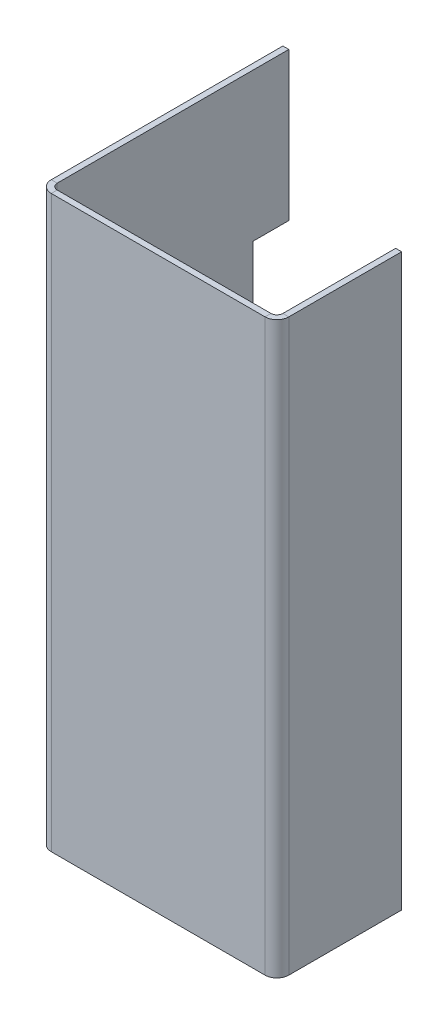
ISO-10303-21;
HEADER;
FILE_DESCRIPTION(('STEP AP214'),'2;1');
FILE_NAME('part.step','',(''),(''),'','','');
FILE_SCHEMA(('AUTOMOTIVE_DESIGN { 1 0 10303 214 1 1 1 1 }'));
ENDSEC;
DATA;
#1=APPLICATION_CONTEXT('core data for automotive mechanical design processes');
#2=APPLICATION_PROTOCOL_DEFINITION('international standard','automotive_design',2000,#1);
#3=PRODUCT_CONTEXT('',#1,'mechanical');
#4=PRODUCT('Part','Part','',(#3));
#5=PRODUCT_RELATED_PRODUCT_CATEGORY('part','',(#4));
#6=PRODUCT_DEFINITION_FORMATION('','',#4);
#7=PRODUCT_DEFINITION_CONTEXT('part definition',#1,'design');
#8=PRODUCT_DEFINITION('design','',#6,#7);
#9=PRODUCT_DEFINITION_SHAPE('','',#8);
#10=(LENGTH_UNIT() NAMED_UNIT(*) SI_UNIT(.MILLI.,.METRE.));
#11=(NAMED_UNIT(*) PLANE_ANGLE_UNIT() SI_UNIT($,.RADIAN.));
#12=(NAMED_UNIT(*) SI_UNIT($,.STERADIAN.) SOLID_ANGLE_UNIT());
#13=UNCERTAINTY_MEASURE_WITH_UNIT(LENGTH_MEASURE(1.E-05),#10,'distance_accuracy_value','');
#14=(GEOMETRIC_REPRESENTATION_CONTEXT(3) GLOBAL_UNCERTAINTY_ASSIGNED_CONTEXT((#13)) GLOBAL_UNIT_ASSIGNED_CONTEXT((#10,
#11,#12)) REPRESENTATION_CONTEXT('',''));
#15=CARTESIAN_POINT('',(0.,0.,0.));
#16=DIRECTION('',(0.,0.,1.));
#17=DIRECTION('',(1.,0.,0.));
#18=AXIS2_PLACEMENT_3D('',#15,#16,#17);
#19=CARTESIAN_POINT('',(-31.7500000000002,76.1999999999999,-65.0875));
#20=DIRECTION('',(0.,0.,-1.));
#21=DIRECTION('',(-1.,0.,0.));
#22=AXIS2_PLACEMENT_3D('',#19,#20,#21);
#23=PLANE('',#22);
#24=DIRECTION('',(1.,0.,0.));
#25=VECTOR('',#24,1.);
#26=CARTESIAN_POINT('',(-31.7500000000004,-45.974,-65.0875));
#27=LINE('',#26,#25);
#28=CARTESIAN_POINT('',(-31.7500000000004,-45.974,-65.0875));
#29=VERTEX_POINT('',#28);
#30=CARTESIAN_POINT('',(-30.1625000000002,-45.974,-65.0875));
#31=VERTEX_POINT('',#30);
#32=EDGE_CURVE('E236',#29,#31,#27,.T.);
#33=ORIENTED_EDGE('',*,*,#32,.T.);
#34=DIRECTION('',(0.,-1.,0.));
#35=VECTOR('',#34,1.);
#36=CARTESIAN_POINT('',(-30.1625000000002,0.,-65.0875));
#37=LINE('',#36,#35);
#38=CARTESIAN_POINT('',(-30.1625000000002,-76.2,-65.0875));
#39=VERTEX_POINT('',#38);
#40=EDGE_CURVE('E278',#39,#31,#37,.F.);
#41=ORIENTED_EDGE('',*,*,#40,.F.);
#42=DIRECTION('',(1.,0.,0.));
#43=VECTOR('',#42,1.);
#44=CARTESIAN_POINT('',(-31.7500000000002,-76.2,-65.0875));
#45=LINE('',#44,#43);
#46=CARTESIAN_POINT('',(-31.7500000000002,-76.2,-65.0875));
#47=VERTEX_POINT('',#46);
#48=EDGE_CURVE('E264',#47,#39,#45,.T.);
#49=ORIENTED_EDGE('',*,*,#48,.F.);
#50=DIRECTION('',(0.,1.,0.));
#51=VECTOR('',#50,1.);
#52=CARTESIAN_POINT('',(-31.7500000000002,76.1999999999999,-65.0875));
#53=LINE('',#52,#51);
#54=EDGE_CURVE('E270',#47,#29,#53,.T.);
#55=ORIENTED_EDGE('',*,*,#54,.T.);
#56=EDGE_LOOP('',(#33,#41,#49,#55));
#57=FACE_BOUND('',#56,.T.);
#58=ADVANCED_FACE('F90',(#57),#23,.T.);
#59=CARTESIAN_POINT('',(-30.1625,0.,1.11022302462516E-13));
#60=DIRECTION('',(-1.,0.,0.));
#61=DIRECTION('',(0.,0.,1.));
#62=AXIS2_PLACEMENT_3D('',#59,#60,#61);
#63=PLANE('',#62);
#64=CARTESIAN_POINT('',(-30.1625,0.,-9.52500000000001));
#65=DIRECTION('',(-1.,0.,0.));
#66=DIRECTION('',(0.,0.,1.));
#67=AXIS2_PLACEMENT_3D('',#64,#65,#66);
#68=CIRCLE('',#67,1.63194999999999);
#69=CARTESIAN_POINT('',(-30.1625,0.,-7.89305000000001));
#70=VERTEX_POINT('',#69);
#71=EDGE_CURVE('E248',#70,#70,#68,.F.);
#72=ORIENTED_EDGE('',*,*,#71,.F.);
#73=EDGE_LOOP('',(#72));
#74=FACE_BOUND('',#73,.T.);
#75=CARTESIAN_POINT('',(-30.1625,50.8,-9.52500000000001));
#76=DIRECTION('',(-1.,0.,0.));
#77=DIRECTION('',(0.,0.,1.));
#78=AXIS2_PLACEMENT_3D('',#75,#76,#77);
#79=CIRCLE('',#78,1.63194999999999);
#80=CARTESIAN_POINT('',(-30.1625,50.8,-7.89305000000002));
#81=VERTEX_POINT('',#80);
#82=EDGE_CURVE('E254',#81,#81,#79,.F.);
#83=ORIENTED_EDGE('',*,*,#82,.F.);
#84=EDGE_LOOP('',(#83));
#85=FACE_BOUND('',#84,.T.);
#86=ORIENTED_EDGE('',*,*,#40,.T.);
#87=DIRECTION('',(0.,0.,-1.));
#88=VECTOR('',#87,1.);
#89=CARTESIAN_POINT('',(-30.1625000000002,-45.974,-65.0875));
#90=LINE('',#89,#88);
#91=CARTESIAN_POINT('',(-30.1625000000002,-45.974,-55.5625));
#92=VERTEX_POINT('',#91);
#93=EDGE_CURVE('E228',#92,#31,#90,.T.);
#94=ORIENTED_EDGE('',*,*,#93,.F.);
#95=DIRECTION('',(0.,-1.,0.));
#96=VECTOR('',#95,1.);
#97=CARTESIAN_POINT('',(-30.1625000000002,36.576,-55.5625));
#98=LINE('',#97,#96);
#99=CARTESIAN_POINT('',(-30.1625000000002,36.576,-55.5625));
#100=VERTEX_POINT('',#99);
#101=EDGE_CURVE('E230',#100,#92,#98,.T.);
#102=ORIENTED_EDGE('',*,*,#101,.F.);
#103=DIRECTION('',(0.,0.,1.));
#104=VECTOR('',#103,1.);
#105=CARTESIAN_POINT('',(-30.1625000000002,36.576,-65.0875));
#106=LINE('',#105,#104);
#107=CARTESIAN_POINT('',(-30.1625000000002,36.576,-65.0875));
#108=VERTEX_POINT('',#107);
#109=EDGE_CURVE('E208',#108,#100,#106,.T.);
#110=ORIENTED_EDGE('',*,*,#109,.F.);
#111=CARTESIAN_POINT('',(-30.1625000000002,76.1999999999999,-65.0875));
#112=VERTEX_POINT('',#111);
#113=EDGE_CURVE('E281',#108,#112,#37,.F.);
#114=ORIENTED_EDGE('',*,*,#113,.T.);
#115=DIRECTION('',(0.,0.,-1.));
#116=VECTOR('',#115,1.);
#117=CARTESIAN_POINT('',(-30.1625,76.2,0.));
#118=LINE('',#117,#116);
#119=CARTESIAN_POINT('',(-30.1625,76.2,-3.17500000000001));
#120=VERTEX_POINT('',#119);
#121=EDGE_CURVE('E275',#112,#120,#118,.F.);
#122=ORIENTED_EDGE('',*,*,#121,.T.);
#123=DIRECTION('',(0.,-1.,0.));
#124=VECTOR('',#123,1.);
#125=CARTESIAN_POINT('',(-30.1625,-76.2,-3.17499999999999));
#126=LINE('',#125,#124);
#127=CARTESIAN_POINT('',(-30.1625,-76.2,-3.17499999999999));
#128=VERTEX_POINT('',#127);
#129=EDGE_CURVE('E290',#128,#120,#126,.F.);
#130=ORIENTED_EDGE('',*,*,#129,.F.);
#131=DIRECTION('',(0.,0.,1.));
#132=VECTOR('',#131,1.);
#133=CARTESIAN_POINT('',(-30.1625,-76.2,1.27675647831893E-13));
#134=LINE('',#133,#132);
#135=EDGE_CURVE('E282',#128,#39,#134,.F.);
#136=ORIENTED_EDGE('',*,*,#135,.T.);
#137=EDGE_LOOP('',(#86,#94,#102,#110,#114,#122,#130,#136));
#138=FACE_BOUND('',#137,.T.);
#139=CARTESIAN_POINT('',(-30.1625,-50.8,-9.52500000000001));
#140=DIRECTION('',(-1.,0.,0.));
#141=DIRECTION('',(0.,0.,1.));
#142=AXIS2_PLACEMENT_3D('',#139,#140,#141);
#143=CIRCLE('',#142,1.63194999999999);
#144=CARTESIAN_POINT('',(-30.1625,-50.8,-7.89305000000002));
#145=VERTEX_POINT('',#144);
#146=EDGE_CURVE('E242',#145,#145,#143,.F.);
#147=ORIENTED_EDGE('',*,*,#146,.F.);
#148=EDGE_LOOP('',(#147));
#149=FACE_BOUND('',#148,.T.);
#150=ADVANCED_FACE('F421',(#74,#85,#138,#149),#63,.F.);
#151=CARTESIAN_POINT('',(0.,0.,-1.5875));
#152=DIRECTION('',(0.,0.,-1.));
#153=DIRECTION('',(-1.,0.,0.));
#154=AXIS2_PLACEMENT_3D('',#151,#152,#153);
#155=PLANE('',#154);
#156=DIRECTION('',(1.,0.,0.));
#157=VECTOR('',#156,1.);
#158=CARTESIAN_POINT('',(-31.75,-76.2,-1.5875));
#159=LINE('',#158,#157);
#160=CARTESIAN_POINT('',(-28.575,-76.2,-1.58749999999999));
#161=VERTEX_POINT('',#160);
#162=CARTESIAN_POINT('',(28.575,-76.2,-1.5875));
#163=VERTEX_POINT('',#162);
#164=EDGE_CURVE('E15',#161,#163,#159,.T.);
#165=ORIENTED_EDGE('',*,*,#164,.F.);
#166=DIRECTION('',(0.,1.,0.));
#167=VECTOR('',#166,1.);
#168=CARTESIAN_POINT('',(-28.575,76.2,-1.58750000000001));
#169=LINE('',#168,#167);
#170=CARTESIAN_POINT('',(-28.575,76.2,-1.58750000000001));
#171=VERTEX_POINT('',#170);
#172=EDGE_CURVE('E306',#171,#161,#169,.F.);
#173=ORIENTED_EDGE('',*,*,#172,.F.);
#174=DIRECTION('',(-1.,0.,0.));
#175=VECTOR('',#174,1.);
#176=CARTESIAN_POINT('',(-31.75,76.2,-1.5875));
#177=LINE('',#176,#175);
#178=CARTESIAN_POINT('',(28.575,76.2,-1.5875));
#179=VERTEX_POINT('',#178);
#180=EDGE_CURVE('E99',#179,#171,#177,.T.);
#181=ORIENTED_EDGE('',*,*,#180,.F.);
#182=DIRECTION('',(0.,-1.,0.));
#183=VECTOR('',#182,1.);
#184=CARTESIAN_POINT('',(28.575,-76.2,-1.58750000000001));
#185=LINE('',#184,#183);
#186=EDGE_CURVE('E361',#163,#179,#185,.F.);
#187=ORIENTED_EDGE('',*,*,#186,.F.);
#188=EDGE_LOOP('',(#165,#173,#181,#187));
#189=FACE_BOUND('',#188,.T.);
#190=ADVANCED_FACE('F428',(#189),#155,.T.);
#191=CARTESIAN_POINT('',(0.,0.,0.));
#192=DIRECTION('',(0.,0.,-1.));
#193=DIRECTION('',(-1.,0.,0.));
#194=AXIS2_PLACEMENT_3D('',#191,#192,#193);
#195=PLANE('',#194);
#196=DIRECTION('',(0.,1.,0.));
#197=VECTOR('',#196,1.);
#198=CARTESIAN_POINT('',(-28.575,76.2,0.));
#199=LINE('',#198,#197);
#200=CARTESIAN_POINT('',(-28.575,76.2,0.));
#201=VERTEX_POINT('',#200);
#202=CARTESIAN_POINT('',(-28.575,-76.2,0.));
#203=VERTEX_POINT('',#202);
#204=EDGE_CURVE('E294',#201,#203,#199,.F.);
#205=ORIENTED_EDGE('',*,*,#204,.T.);
#206=DIRECTION('',(1.,0.,0.));
#207=VECTOR('',#206,1.);
#208=CARTESIAN_POINT('',(-31.75,-76.2,0.));
#209=LINE('',#208,#207);
#210=CARTESIAN_POINT('',(28.575,-76.2,0.));
#211=VERTEX_POINT('',#210);
#212=EDGE_CURVE('E94',#203,#211,#209,.T.);
#213=ORIENTED_EDGE('',*,*,#212,.T.);
#214=DIRECTION('',(0.,-1.,0.));
#215=VECTOR('',#214,1.);
#216=CARTESIAN_POINT('',(28.575,-76.2,0.));
#217=LINE('',#216,#215);
#218=CARTESIAN_POINT('',(28.575,76.2,0.));
#219=VERTEX_POINT('',#218);
#220=EDGE_CURVE('E349',#211,#219,#217,.F.);
#221=ORIENTED_EDGE('',*,*,#220,.T.);
#222=DIRECTION('',(-1.,0.,0.));
#223=VECTOR('',#222,1.);
#224=CARTESIAN_POINT('',(-31.75,76.2,0.));
#225=LINE('',#224,#223);
#226=EDGE_CURVE('E367',#219,#201,#225,.T.);
#227=ORIENTED_EDGE('',*,*,#226,.T.);
#228=EDGE_LOOP('',(#205,#213,#221,#227));
#229=FACE_BOUND('',#228,.T.);
#230=ADVANCED_FACE('F372',(#229),#195,.F.);
#231=CARTESIAN_POINT('',(-31.75,76.2,-1.5875));
#232=DIRECTION('',(0.,1.,0.));
#233=DIRECTION('',(0.,0.,1.));
#234=AXIS2_PLACEMENT_3D('',#231,#232,#233);
#235=PLANE('',#234);
#236=ORIENTED_EDGE('',*,*,#180,.T.);
#237=DIRECTION('',(0.,0.,1.));
#238=VECTOR('',#237,1.);
#239=CARTESIAN_POINT('',(-28.575,76.2,-1.58750000000001));
#240=LINE('',#239,#238);
#241=EDGE_CURVE('E300',#171,#201,#240,.T.);
#242=ORIENTED_EDGE('',*,*,#241,.T.);
#243=ORIENTED_EDGE('',*,*,#226,.F.);
#244=DIRECTION('',(0.,0.,1.));
#245=VECTOR('',#244,1.);
#246=CARTESIAN_POINT('',(28.575,76.2,-1.58749999999999));
#247=LINE('',#246,#245);
#248=EDGE_CURVE('E115',#179,#219,#247,.T.);
#249=ORIENTED_EDGE('',*,*,#248,.F.);
#250=EDGE_LOOP('',(#236,#242,#243,#249));
#251=FACE_BOUND('',#250,.T.);
#252=ADVANCED_FACE('F92',(#251),#235,.T.);
#253=CARTESIAN_POINT('',(-31.75,-76.2,-1.5875));
#254=DIRECTION('',(0.,-1.,0.));
#255=DIRECTION('',(0.,0.,-1.));
#256=AXIS2_PLACEMENT_3D('',#253,#254,#255);
#257=PLANE('',#256);
#258=DIRECTION('',(0.,0.,1.));
#259=VECTOR('',#258,1.);
#260=CARTESIAN_POINT('',(-28.575,-76.2,-1.58749999999999));
#261=LINE('',#260,#259);
#262=EDGE_CURVE('E311',#161,#203,#261,.T.);
#263=ORIENTED_EDGE('',*,*,#262,.F.);
#264=ORIENTED_EDGE('',*,*,#164,.T.);
#265=DIRECTION('',(0.,0.,1.));
#266=VECTOR('',#265,1.);
#267=CARTESIAN_POINT('',(28.575,-76.2,-1.58750000000001));
#268=LINE('',#267,#266);
#269=EDGE_CURVE('E355',#163,#211,#268,.T.);
#270=ORIENTED_EDGE('',*,*,#269,.T.);
#271=ORIENTED_EDGE('',*,*,#212,.F.);
#272=EDGE_LOOP('',(#263,#264,#270,#271));
#273=FACE_BOUND('',#272,.T.);
#274=ADVANCED_FACE('F377',(#273),#257,.T.);
#275=CARTESIAN_POINT('',(28.575,76.2,-3.17499999999999));
#276=DIRECTION('',(0.,1.,0.));
#277=DIRECTION('',(0.,0.,1.));
#278=AXIS2_PLACEMENT_3D('',#275,#276,#277);
#279=PLANE('',#278);
#280=DIRECTION('',(1.,0.,0.));
#281=VECTOR('',#280,1.);
#282=CARTESIAN_POINT('',(31.75,76.2,-3.17499999999999));
#283=LINE('',#282,#281);
#284=CARTESIAN_POINT('',(30.1625,76.2,-3.17499999999999));
#285=VERTEX_POINT('',#284);
#286=CARTESIAN_POINT('',(31.75,76.2,-3.17499999999998));
#287=VERTEX_POINT('',#286);
#288=EDGE_CURVE('E314',#285,#287,#283,.T.);
#289=ORIENTED_EDGE('',*,*,#288,.F.);
#290=CARTESIAN_POINT('',(28.575,76.2,-3.17499999999999));
#291=DIRECTION('',(0.,-1.,0.));
#292=DIRECTION('',(0.,0.,-1.));
#293=AXIS2_PLACEMENT_3D('',#290,#291,#292);
#294=CIRCLE('',#293,1.5875);
#295=EDGE_CURVE('E358',#179,#285,#294,.F.);
#296=ORIENTED_EDGE('',*,*,#295,.F.);
#297=ORIENTED_EDGE('',*,*,#248,.T.);
#298=CARTESIAN_POINT('',(28.575,76.2,-3.17499999999999));
#299=DIRECTION('',(0.,-1.,0.));
#300=DIRECTION('',(0.,0.,-1.));
#301=AXIS2_PLACEMENT_3D('',#298,#299,#300);
#302=CIRCLE('',#301,3.175);
#303=EDGE_CURVE('E351',#219,#287,#302,.F.);
#304=ORIENTED_EDGE('',*,*,#303,.T.);
#305=EDGE_LOOP('',(#289,#296,#297,#304));
#306=FACE_BOUND('',#305,.T.);
#307=ADVANCED_FACE('F404',(#306),#279,.T.);
#308=CARTESIAN_POINT('',(28.575,-76.2,-3.17500000000001));
#309=DIRECTION('',(0.,1.,0.));
#310=DIRECTION('',(0.,0.,1.));
#311=AXIS2_PLACEMENT_3D('',#308,#309,#310);
#312=PLANE('',#311);
#313=CARTESIAN_POINT('',(28.575,-76.2,-3.17500000000001));
#314=DIRECTION('',(0.,-1.,0.));
#315=DIRECTION('',(0.,0.,-1.));
#316=AXIS2_PLACEMENT_3D('',#313,#314,#315);
#317=CIRCLE('',#316,1.5875);
#318=CARTESIAN_POINT('',(30.1625,-76.2,-3.17500000000001));
#319=VERTEX_POINT('',#318);
#320=EDGE_CURVE('E319',#319,#163,#317,.T.);
#321=ORIENTED_EDGE('',*,*,#320,.F.);
#322=DIRECTION('',(1.,0.,0.));
#323=VECTOR('',#322,1.);
#324=CARTESIAN_POINT('',(30.1625,-76.2,-3.175));
#325=LINE('',#324,#323);
#326=CARTESIAN_POINT('',(31.75,-76.2,-3.175));
#327=VERTEX_POINT('',#326);
#328=EDGE_CURVE('E342',#319,#327,#325,.T.);
#329=ORIENTED_EDGE('',*,*,#328,.T.);
#330=CARTESIAN_POINT('',(28.575,-76.2,-3.17500000000001));
#331=DIRECTION('',(0.,-1.,0.));
#332=DIRECTION('',(0.,0.,-1.));
#333=AXIS2_PLACEMENT_3D('',#330,#331,#332);
#334=CIRCLE('',#333,3.175);
#335=EDGE_CURVE('E352',#327,#211,#334,.T.);
#336=ORIENTED_EDGE('',*,*,#335,.T.);
#337=ORIENTED_EDGE('',*,*,#269,.F.);
#338=EDGE_LOOP('',(#321,#329,#336,#337));
#339=FACE_BOUND('',#338,.T.);
#340=ADVANCED_FACE('F385',(#339),#312,.F.);
#341=CARTESIAN_POINT('',(28.575,-76.2,-3.17500000000001));
#342=DIRECTION('',(0.,-1.,0.));
#343=DIRECTION('',(1.,0.,0.));
#344=AXIS2_PLACEMENT_3D('',#341,#342,#343);
#345=CYLINDRICAL_SURFACE('',#344,3.175);
#346=ORIENTED_EDGE('',*,*,#220,.F.);
#347=ORIENTED_EDGE('',*,*,#335,.F.);
#348=DIRECTION('',(0.,-1.,0.));
#349=VECTOR('',#348,1.);
#350=CARTESIAN_POINT('',(31.75,0.,-3.17499999999999));
#351=LINE('',#350,#349);
#352=EDGE_CURVE('E339',#287,#327,#351,.T.);
#353=ORIENTED_EDGE('',*,*,#352,.F.);
#354=ORIENTED_EDGE('',*,*,#303,.F.);
#355=EDGE_LOOP('',(#346,#347,#353,#354));
#356=FACE_BOUND('',#355,.T.);
#357=ADVANCED_FACE('F384',(#356),#345,.T.);
#358=CARTESIAN_POINT('',(28.575,-76.2,-3.17500000000001));
#359=DIRECTION('',(0.,-1.,0.));
#360=DIRECTION('',(1.,0.,0.));
#361=AXIS2_PLACEMENT_3D('',#358,#359,#360);
#362=CYLINDRICAL_SURFACE('',#361,1.5875);
#363=ORIENTED_EDGE('',*,*,#186,.T.);
#364=ORIENTED_EDGE('',*,*,#295,.T.);
#365=DIRECTION('',(0.,1.,0.));
#366=VECTOR('',#365,1.);
#367=CARTESIAN_POINT('',(30.1625,76.2,-3.17499999999999));
#368=LINE('',#367,#366);
#369=EDGE_CURVE('E345',#285,#319,#368,.F.);
#370=ORIENTED_EDGE('',*,*,#369,.T.);
#371=ORIENTED_EDGE('',*,*,#320,.T.);
#372=EDGE_LOOP('',(#363,#364,#370,#371));
#373=FACE_BOUND('',#372,.T.);
#374=ADVANCED_FACE('F407',(#373),#362,.F.);
#375=CARTESIAN_POINT('',(31.75,-76.2,-1.58749999999999));
#376=DIRECTION('',(0.,-1.,0.));
#377=DIRECTION('',(0.,0.,-1.));
#378=AXIS2_PLACEMENT_3D('',#375,#376,#377);
#379=PLANE('',#378);
#380=DIRECTION('',(0.,0.,1.));
#381=VECTOR('',#380,1.);
#382=CARTESIAN_POINT('',(31.75,-76.2,-1.58749999999999));
#383=LINE('',#382,#381);
#384=CARTESIAN_POINT('',(31.7500000000001,-76.2,-33.3375));
#385=VERTEX_POINT('',#384);
#386=EDGE_CURVE('E323',#385,#327,#383,.T.);
#387=ORIENTED_EDGE('',*,*,#386,.T.);
#388=ORIENTED_EDGE('',*,*,#328,.F.);
#389=DIRECTION('',(0.,0.,-1.));
#390=VECTOR('',#389,1.);
#391=CARTESIAN_POINT('',(30.1625,-76.2,0.));
#392=LINE('',#391,#390);
#393=CARTESIAN_POINT('',(30.1625000000001,-76.2,-33.3375));
#394=VERTEX_POINT('',#393);
#395=EDGE_CURVE('E331',#394,#319,#392,.F.);
#396=ORIENTED_EDGE('',*,*,#395,.F.);
#397=DIRECTION('',(-1.,0.,0.));
#398=VECTOR('',#397,1.);
#399=CARTESIAN_POINT('',(31.7500000000001,-76.2,-33.3375));
#400=LINE('',#399,#398);
#401=EDGE_CURVE('E317',#385,#394,#400,.T.);
#402=ORIENTED_EDGE('',*,*,#401,.F.);
#403=EDGE_LOOP('',(#387,#388,#396,#402));
#404=FACE_BOUND('',#403,.T.);
#405=ADVANCED_FACE('F394',(#404),#379,.T.);
#406=CARTESIAN_POINT('',(31.7500000000001,76.2,-33.3375));
#407=DIRECTION('',(0.,1.,0.));
#408=DIRECTION('',(0.,0.,1.));
#409=AXIS2_PLACEMENT_3D('',#406,#407,#408);
#410=PLANE('',#409);
#411=DIRECTION('',(0.,0.,1.));
#412=VECTOR('',#411,1.);
#413=CARTESIAN_POINT('',(30.1625,76.2,1.4432899320127E-13));
#414=LINE('',#413,#412);
#415=CARTESIAN_POINT('',(30.1625000000001,76.2,-33.3375));
#416=VERTEX_POINT('',#415);
#417=EDGE_CURVE('E337',#285,#416,#414,.F.);
#418=ORIENTED_EDGE('',*,*,#417,.F.);
#419=ORIENTED_EDGE('',*,*,#288,.T.);
#420=DIRECTION('',(0.,0.,-1.));
#421=VECTOR('',#420,1.);
#422=CARTESIAN_POINT('',(31.7500000000001,76.2,-33.3375));
#423=LINE('',#422,#421);
#424=CARTESIAN_POINT('',(31.7500000000001,76.2,-33.3375));
#425=VERTEX_POINT('',#424);
#426=EDGE_CURVE('E329',#287,#425,#423,.T.);
#427=ORIENTED_EDGE('',*,*,#426,.T.);
#428=DIRECTION('',(-1.,0.,0.));
#429=VECTOR('',#428,1.);
#430=CARTESIAN_POINT('',(31.7500000000001,76.2,-33.3375));
#431=LINE('',#430,#429);
#432=EDGE_CURVE('E320',#425,#416,#431,.T.);
#433=ORIENTED_EDGE('',*,*,#432,.T.);
#434=EDGE_LOOP('',(#418,#419,#427,#433));
#435=FACE_BOUND('',#434,.T.);
#436=ADVANCED_FACE('F401',(#435),#410,.T.);
#437=CARTESIAN_POINT('',(31.75,0.,1.16565029087929E-13));
#438=DIRECTION('',(1.,0.,0.));
#439=DIRECTION('',(0.,0.,-1.));
#440=AXIS2_PLACEMENT_3D('',#437,#438,#439);
#441=PLANE('',#440);
#442=ORIENTED_EDGE('',*,*,#426,.F.);
#443=ORIENTED_EDGE('',*,*,#352,.T.);
#444=ORIENTED_EDGE('',*,*,#386,.F.);
#445=DIRECTION('',(0.,-1.,0.));
#446=VECTOR('',#445,1.);
#447=CARTESIAN_POINT('',(31.7500000000001,-76.2,-33.3375));
#448=LINE('',#447,#446);
#449=EDGE_CURVE('E326',#425,#385,#448,.T.);
#450=ORIENTED_EDGE('',*,*,#449,.F.);
#451=EDGE_LOOP('',(#442,#443,#444,#450));
#452=FACE_BOUND('',#451,.T.);
#453=ADVANCED_FACE('F392',(#452),#441,.T.);
#454=CARTESIAN_POINT('',(30.1625,0.,1.11022302462516E-13));
#455=DIRECTION('',(1.,0.,0.));
#456=DIRECTION('',(0.,0.,-1.));
#457=AXIS2_PLACEMENT_3D('',#454,#455,#456);
#458=PLANE('',#457);
#459=ORIENTED_EDGE('',*,*,#369,.F.);
#460=ORIENTED_EDGE('',*,*,#417,.T.);
#461=DIRECTION('',(0.,1.,0.));
#462=VECTOR('',#461,1.);
#463=CARTESIAN_POINT('',(30.1625000000001,0.,-33.3375));
#464=LINE('',#463,#462);
#465=EDGE_CURVE('E334',#416,#394,#464,.F.);
#466=ORIENTED_EDGE('',*,*,#465,.T.);
#467=ORIENTED_EDGE('',*,*,#395,.T.);
#468=EDGE_LOOP('',(#459,#460,#466,#467));
#469=FACE_BOUND('',#468,.T.);
#470=ADVANCED_FACE('F409',(#469),#458,.F.);
#471=CARTESIAN_POINT('',(31.7500000000001,-76.2,-33.3375));
#472=DIRECTION('',(0.,0.,-1.));
#473=DIRECTION('',(-1.,0.,0.));
#474=AXIS2_PLACEMENT_3D('',#471,#472,#473);
#475=PLANE('',#474);
#476=ORIENTED_EDGE('',*,*,#465,.F.);
#477=ORIENTED_EDGE('',*,*,#432,.F.);
#478=ORIENTED_EDGE('',*,*,#449,.T.);
#479=ORIENTED_EDGE('',*,*,#401,.T.);
#480=EDGE_LOOP('',(#476,#477,#478,#479));
#481=FACE_BOUND('',#480,.T.);
#482=ADVANCED_FACE('F398',(#481),#475,.T.);
#483=CARTESIAN_POINT('',(-28.575,-76.2,-3.17499999999999));
#484=DIRECTION('',(0.,-1.,0.));
#485=DIRECTION('',(0.,0.,-1.));
#486=AXIS2_PLACEMENT_3D('',#483,#484,#485);
#487=PLANE('',#486);
#488=DIRECTION('',(-1.,0.,0.));
#489=VECTOR('',#488,1.);
#490=CARTESIAN_POINT('',(-31.75,-76.2,-3.17499999999999));
#491=LINE('',#490,#489);
#492=CARTESIAN_POINT('',(-31.75,-76.2,-3.17499999999998));
#493=VERTEX_POINT('',#492);
#494=EDGE_CURVE('E257',#128,#493,#491,.T.);
#495=ORIENTED_EDGE('',*,*,#494,.F.);
#496=CARTESIAN_POINT('',(-28.575,-76.2,-3.17499999999999));
#497=DIRECTION('',(0.,1.,0.));
#498=DIRECTION('',(0.,0.,1.));
#499=AXIS2_PLACEMENT_3D('',#496,#497,#498);
#500=CIRCLE('',#499,1.5875);
#501=EDGE_CURVE('E303',#161,#128,#500,.F.);
#502=ORIENTED_EDGE('',*,*,#501,.F.);
#503=ORIENTED_EDGE('',*,*,#262,.T.);
#504=CARTESIAN_POINT('',(-28.575,-76.2,-3.17499999999999));
#505=DIRECTION('',(0.,1.,0.));
#506=DIRECTION('',(0.,0.,1.));
#507=AXIS2_PLACEMENT_3D('',#504,#505,#506);
#508=CIRCLE('',#507,3.175);
#509=EDGE_CURVE('E296',#203,#493,#508,.F.);
#510=ORIENTED_EDGE('',*,*,#509,.T.);
#511=EDGE_LOOP('',(#495,#502,#503,#510));
#512=FACE_BOUND('',#511,.T.);
#513=ADVANCED_FACE('F416',(#512),#487,.T.);
#514=CARTESIAN_POINT('',(-28.575,76.2,-3.17500000000001));
#515=DIRECTION('',(0.,-1.,0.));
#516=DIRECTION('',(0.,0.,-1.));
#517=AXIS2_PLACEMENT_3D('',#514,#515,#516);
#518=PLANE('',#517);
#519=CARTESIAN_POINT('',(-28.575,76.2,-3.17500000000001));
#520=DIRECTION('',(0.,1.,0.));
#521=DIRECTION('',(0.,0.,1.));
#522=AXIS2_PLACEMENT_3D('',#519,#520,#521);
#523=CIRCLE('',#522,1.5875);
#524=EDGE_CURVE('E263',#120,#171,#523,.T.);
#525=ORIENTED_EDGE('',*,*,#524,.F.);
#526=DIRECTION('',(-1.,0.,0.));
#527=VECTOR('',#526,1.);
#528=CARTESIAN_POINT('',(-30.1625,76.2,-3.175));
#529=LINE('',#528,#527);
#530=CARTESIAN_POINT('',(-31.75,76.2,-3.175));
#531=VERTEX_POINT('',#530);
#532=EDGE_CURVE('E287',#120,#531,#529,.T.);
#533=ORIENTED_EDGE('',*,*,#532,.T.);
#534=CARTESIAN_POINT('',(-28.575,76.2,-3.17500000000001));
#535=DIRECTION('',(0.,1.,0.));
#536=DIRECTION('',(0.,0.,1.));
#537=AXIS2_PLACEMENT_3D('',#534,#535,#536);
#538=CIRCLE('',#537,3.175);
#539=EDGE_CURVE('E297',#531,#201,#538,.T.);
#540=ORIENTED_EDGE('',*,*,#539,.T.);
#541=ORIENTED_EDGE('',*,*,#241,.F.);
#542=EDGE_LOOP('',(#525,#533,#540,#541));
#543=FACE_BOUND('',#542,.T.);
#544=ADVANCED_FACE('F470',(#543),#518,.F.);
#545=CARTESIAN_POINT('',(-28.575,76.2,-3.17500000000001));
#546=DIRECTION('',(0.,1.,0.));
#547=DIRECTION('',(-1.,0.,0.));
#548=AXIS2_PLACEMENT_3D('',#545,#546,#547);
#549=CYLINDRICAL_SURFACE('',#548,3.175);
#550=ORIENTED_EDGE('',*,*,#204,.F.);
#551=ORIENTED_EDGE('',*,*,#539,.F.);
#552=DIRECTION('',(0.,1.,0.));
#553=VECTOR('',#552,1.);
#554=CARTESIAN_POINT('',(-31.75,0.,-3.17499999999999));
#555=LINE('',#554,#553);
#556=EDGE_CURVE('E284',#493,#531,#555,.T.);
#557=ORIENTED_EDGE('',*,*,#556,.F.);
#558=ORIENTED_EDGE('',*,*,#509,.F.);
#559=EDGE_LOOP('',(#550,#551,#557,#558));
#560=FACE_BOUND('',#559,.T.);
#561=ADVANCED_FACE('F473',(#560),#549,.T.);
#562=CARTESIAN_POINT('',(-28.575,76.2,-3.17500000000001));
#563=DIRECTION('',(0.,1.,0.));
#564=DIRECTION('',(-1.,0.,0.));
#565=AXIS2_PLACEMENT_3D('',#562,#563,#564);
#566=CYLINDRICAL_SURFACE('',#565,1.5875);
#567=ORIENTED_EDGE('',*,*,#172,.T.);
#568=ORIENTED_EDGE('',*,*,#501,.T.);
#569=ORIENTED_EDGE('',*,*,#129,.T.);
#570=ORIENTED_EDGE('',*,*,#524,.T.);
#571=EDGE_LOOP('',(#567,#568,#569,#570));
#572=FACE_BOUND('',#571,.T.);
#573=ADVANCED_FACE('F463',(#572),#566,.F.);
#574=CARTESIAN_POINT('',(-31.75,76.2,-1.58749999999999));
#575=DIRECTION('',(0.,1.,0.));
#576=DIRECTION('',(0.,0.,1.));
#577=AXIS2_PLACEMENT_3D('',#574,#575,#576);
#578=PLANE('',#577);
#579=DIRECTION('',(0.,0.,1.));
#580=VECTOR('',#579,1.);
#581=CARTESIAN_POINT('',(-31.75,76.2,-1.58749999999999));
#582=LINE('',#581,#580);
#583=CARTESIAN_POINT('',(-31.7500000000002,76.1999999999999,-65.0875));
#584=VERTEX_POINT('',#583);
#585=EDGE_CURVE('E267',#584,#531,#582,.T.);
#586=ORIENTED_EDGE('',*,*,#585,.T.);
#587=ORIENTED_EDGE('',*,*,#532,.F.);
#588=ORIENTED_EDGE('',*,*,#121,.F.);
#589=DIRECTION('',(1.,0.,0.));
#590=VECTOR('',#589,1.);
#591=CARTESIAN_POINT('',(-31.7500000000002,76.1999999999999,-65.0875));
#592=LINE('',#591,#590);
#593=EDGE_CURVE('E260',#584,#112,#592,.T.);
#594=ORIENTED_EDGE('',*,*,#593,.F.);
#595=EDGE_LOOP('',(#586,#587,#588,#594));
#596=FACE_BOUND('',#595,.T.);
#597=ADVANCED_FACE('F468',(#596),#578,.T.);
#598=CARTESIAN_POINT('',(-31.7500000000002,-76.2,-65.0875));
#599=DIRECTION('',(0.,-1.,0.));
#600=DIRECTION('',(0.,0.,-1.));
#601=AXIS2_PLACEMENT_3D('',#598,#599,#600);
#602=PLANE('',#601);
#603=ORIENTED_EDGE('',*,*,#135,.F.);
#604=ORIENTED_EDGE('',*,*,#494,.T.);
#605=DIRECTION('',(0.,0.,-1.));
#606=VECTOR('',#605,1.);
#607=CARTESIAN_POINT('',(-31.7500000000002,-76.2,-65.0875));
#608=LINE('',#607,#606);
#609=EDGE_CURVE('E273',#493,#47,#608,.T.);
#610=ORIENTED_EDGE('',*,*,#609,.T.);
#611=ORIENTED_EDGE('',*,*,#48,.T.);
#612=EDGE_LOOP('',(#603,#604,#610,#611));
#613=FACE_BOUND('',#612,.T.);
#614=ADVANCED_FACE('F443',(#613),#602,.T.);
#615=CARTESIAN_POINT('',(-31.75,0.,1.16565029087929E-13));
#616=DIRECTION('',(-1.,0.,0.));
#617=DIRECTION('',(0.,0.,1.));
#618=AXIS2_PLACEMENT_3D('',#615,#616,#617);
#619=PLANE('',#618);
#620=DIRECTION('',(0.,0.,-1.));
#621=VECTOR('',#620,1.);
#622=CARTESIAN_POINT('',(-31.7500000000004,-45.974,-65.0875));
#623=LINE('',#622,#621);
#624=CARTESIAN_POINT('',(-31.7500000000004,-45.974,-55.5625));
#625=VERTEX_POINT('',#624);
#626=EDGE_CURVE('E221',#625,#29,#623,.T.);
#627=ORIENTED_EDGE('',*,*,#626,.T.);
#628=ORIENTED_EDGE('',*,*,#54,.F.);
#629=ORIENTED_EDGE('',*,*,#609,.F.);
#630=ORIENTED_EDGE('',*,*,#556,.T.);
#631=ORIENTED_EDGE('',*,*,#585,.F.);
#632=CARTESIAN_POINT('',(-31.7500000000002,36.576,-65.0875));
#633=VERTEX_POINT('',#632);
#634=EDGE_CURVE('E227',#633,#584,#53,.T.);
#635=ORIENTED_EDGE('',*,*,#634,.F.);
#636=DIRECTION('',(0.,0.,1.));
#637=VECTOR('',#636,1.);
#638=CARTESIAN_POINT('',(-31.7500000000004,36.576,-65.0875));
#639=LINE('',#638,#637);
#640=CARTESIAN_POINT('',(-31.7500000000004,36.576,-55.5625));
#641=VERTEX_POINT('',#640);
#642=EDGE_CURVE('E107',#633,#641,#639,.T.);
#643=ORIENTED_EDGE('',*,*,#642,.T.);
#644=DIRECTION('',(0.,-1.,0.));
#645=VECTOR('',#644,1.);
#646=CARTESIAN_POINT('',(-31.7500000000004,36.576,-55.5625));
#647=LINE('',#646,#645);
#648=EDGE_CURVE('E216',#641,#625,#647,.T.);
#649=ORIENTED_EDGE('',*,*,#648,.T.);
#650=EDGE_LOOP('',(#627,#628,#629,#630,#631,#635,#643,#649));
#651=FACE_BOUND('',#650,.T.);
#652=CARTESIAN_POINT('',(-31.75,-50.8,-9.525));
#653=DIRECTION('',(-1.,0.,0.));
#654=DIRECTION('',(0.,0.,1.));
#655=AXIS2_PLACEMENT_3D('',#652,#653,#654);
#656=CIRCLE('',#655,1.63194999999999);
#657=CARTESIAN_POINT('',(-31.75,-50.8,-7.89305000000002));
#658=VERTEX_POINT('',#657);
#659=EDGE_CURVE('E239',#658,#658,#656,.T.);
#660=ORIENTED_EDGE('',*,*,#659,.F.);
#661=EDGE_LOOP('',(#660));
#662=FACE_BOUND('',#661,.T.);
#663=CARTESIAN_POINT('',(-31.75,0.,-9.525));
#664=DIRECTION('',(-1.,0.,0.));
#665=DIRECTION('',(0.,0.,1.));
#666=AXIS2_PLACEMENT_3D('',#663,#664,#665);
#667=CIRCLE('',#666,1.63194999999999);
#668=CARTESIAN_POINT('',(-31.75,0.,-7.89305000000001));
#669=VERTEX_POINT('',#668);
#670=EDGE_CURVE('E245',#669,#669,#667,.T.);
#671=ORIENTED_EDGE('',*,*,#670,.F.);
#672=EDGE_LOOP('',(#671));
#673=FACE_BOUND('',#672,.T.);
#674=CARTESIAN_POINT('',(-31.75,50.8,-9.525));
#675=DIRECTION('',(-1.,0.,0.));
#676=DIRECTION('',(0.,0.,1.));
#677=AXIS2_PLACEMENT_3D('',#674,#675,#676);
#678=CIRCLE('',#677,1.63194999999999);
#679=CARTESIAN_POINT('',(-31.75,50.8,-7.89305000000002));
#680=VERTEX_POINT('',#679);
#681=EDGE_CURVE('E251',#680,#680,#678,.T.);
#682=ORIENTED_EDGE('',*,*,#681,.F.);
#683=EDGE_LOOP('',(#682));
#684=FACE_BOUND('',#683,.T.);
#685=ADVANCED_FACE('F224',(#651,#662,#673,#684),#619,.T.);
#686=DIRECTION('',(1.,0.,0.));
#687=VECTOR('',#686,1.);
#688=CARTESIAN_POINT('',(-31.7500000000004,36.576,-65.0875));
#689=LINE('',#688,#687);
#690=EDGE_CURVE('E213',#633,#108,#689,.T.);
#691=ORIENTED_EDGE('',*,*,#690,.F.);
#692=ORIENTED_EDGE('',*,*,#634,.T.);
#693=ORIENTED_EDGE('',*,*,#593,.T.);
#694=ORIENTED_EDGE('',*,*,#113,.F.);
#695=EDGE_LOOP('',(#691,#692,#693,#694));
#696=FACE_BOUND('',#695,.T.);
#697=ADVANCED_FACE('F424',(#696),#23,.T.);
#698=CARTESIAN_POINT('',(-31.75,50.8,-9.525));
#699=DIRECTION('',(-1.,0.,0.));
#700=DIRECTION('',(0.,0.,1.));
#701=AXIS2_PLACEMENT_3D('',#698,#699,#700);
#702=CYLINDRICAL_SURFACE('',#701,1.63194999999999);
#703=ORIENTED_EDGE('',*,*,#82,.T.);
#704=EDGE_LOOP('',(#703));
#705=FACE_BOUND('',#704,.T.);
#706=ORIENTED_EDGE('',*,*,#681,.T.);
#707=EDGE_LOOP('',(#706));
#708=FACE_BOUND('',#707,.T.);
#709=ADVANCED_FACE('F434',(#705,#708),#702,.F.);
#710=CARTESIAN_POINT('',(-31.75,0.,-9.525));
#711=DIRECTION('',(-1.,0.,0.));
#712=DIRECTION('',(0.,0.,1.));
#713=AXIS2_PLACEMENT_3D('',#710,#711,#712);
#714=CYLINDRICAL_SURFACE('',#713,1.63194999999999);
#715=ORIENTED_EDGE('',*,*,#71,.T.);
#716=EDGE_LOOP('',(#715));
#717=FACE_BOUND('',#716,.T.);
#718=ORIENTED_EDGE('',*,*,#670,.T.);
#719=EDGE_LOOP('',(#718));
#720=FACE_BOUND('',#719,.T.);
#721=ADVANCED_FACE('F440',(#717,#720),#714,.F.);
#722=CARTESIAN_POINT('',(-31.75,-50.8,-9.525));
#723=DIRECTION('',(-1.,0.,0.));
#724=DIRECTION('',(0.,0.,1.));
#725=AXIS2_PLACEMENT_3D('',#722,#723,#724);
#726=CYLINDRICAL_SURFACE('',#725,1.63194999999999);
#727=ORIENTED_EDGE('',*,*,#146,.T.);
#728=EDGE_LOOP('',(#727));
#729=FACE_BOUND('',#728,.T.);
#730=ORIENTED_EDGE('',*,*,#659,.T.);
#731=EDGE_LOOP('',(#730));
#732=FACE_BOUND('',#731,.T.);
#733=ADVANCED_FACE('F539',(#729,#732),#726,.F.);
#734=CARTESIAN_POINT('',(-31.7500000000004,-45.974,-65.0875));
#735=DIRECTION('',(0.,-1.,0.));
#736=DIRECTION('',(0.,0.,-1.));
#737=AXIS2_PLACEMENT_3D('',#734,#735,#736);
#738=PLANE('',#737);
#739=ORIENTED_EDGE('',*,*,#93,.T.);
#740=ORIENTED_EDGE('',*,*,#32,.F.);
#741=ORIENTED_EDGE('',*,*,#626,.F.);
#742=DIRECTION('',(1.,0.,0.));
#743=VECTOR('',#742,1.);
#744=CARTESIAN_POINT('',(-31.7500000000004,-45.974,-55.5625));
#745=LINE('',#744,#743);
#746=EDGE_CURVE('E212',#625,#92,#745,.T.);
#747=ORIENTED_EDGE('',*,*,#746,.T.);
#748=EDGE_LOOP('',(#739,#740,#741,#747));
#749=FACE_BOUND('',#748,.T.);
#750=ADVANCED_FACE('F452',(#749),#738,.F.);
#751=CARTESIAN_POINT('',(-31.7500000000004,36.576,-55.5625));
#752=DIRECTION('',(0.,0.,1.));
#753=DIRECTION('',(1.,0.,0.));
#754=AXIS2_PLACEMENT_3D('',#751,#752,#753);
#755=PLANE('',#754);
#756=ORIENTED_EDGE('',*,*,#101,.T.);
#757=ORIENTED_EDGE('',*,*,#746,.F.);
#758=ORIENTED_EDGE('',*,*,#648,.F.);
#759=DIRECTION('',(1.,0.,0.));
#760=VECTOR('',#759,1.);
#761=CARTESIAN_POINT('',(-31.7500000000004,36.576,-55.5625));
#762=LINE('',#761,#760);
#763=EDGE_CURVE('E204',#641,#100,#762,.T.);
#764=ORIENTED_EDGE('',*,*,#763,.T.);
#765=EDGE_LOOP('',(#756,#757,#758,#764));
#766=FACE_BOUND('',#765,.T.);
#767=ADVANCED_FACE('F217',(#766),#755,.F.);
#768=CARTESIAN_POINT('',(-31.7500000000004,36.576,-65.0875));
#769=DIRECTION('',(0.,1.,0.));
#770=DIRECTION('',(0.,0.,1.));
#771=AXIS2_PLACEMENT_3D('',#768,#769,#770);
#772=PLANE('',#771);
#773=ORIENTED_EDGE('',*,*,#109,.T.);
#774=ORIENTED_EDGE('',*,*,#763,.F.);
#775=ORIENTED_EDGE('',*,*,#642,.F.);
#776=ORIENTED_EDGE('',*,*,#690,.T.);
#777=EDGE_LOOP('',(#773,#774,#775,#776));
#778=FACE_BOUND('',#777,.T.);
#779=ADVANCED_FACE('F206',(#778),#772,.F.);
#780=CLOSED_SHELL('',(#58,#150,#190,#230,#252,#274,#307,#340,#357,#374,#405,#436,#453,#470,#482,
#513,#544,#561,#573,#597,#614,#685,#697,#709,#721,#733,#750,#767,#779));
#781=MANIFOLD_SOLID_BREP('B2',#780);
#782=ADVANCED_BREP_SHAPE_REPRESENTATION('',(#18,#781),#14);
#783=SHAPE_DEFINITION_REPRESENTATION(#9,#782);
ENDSEC;
END-ISO-10303-21;
